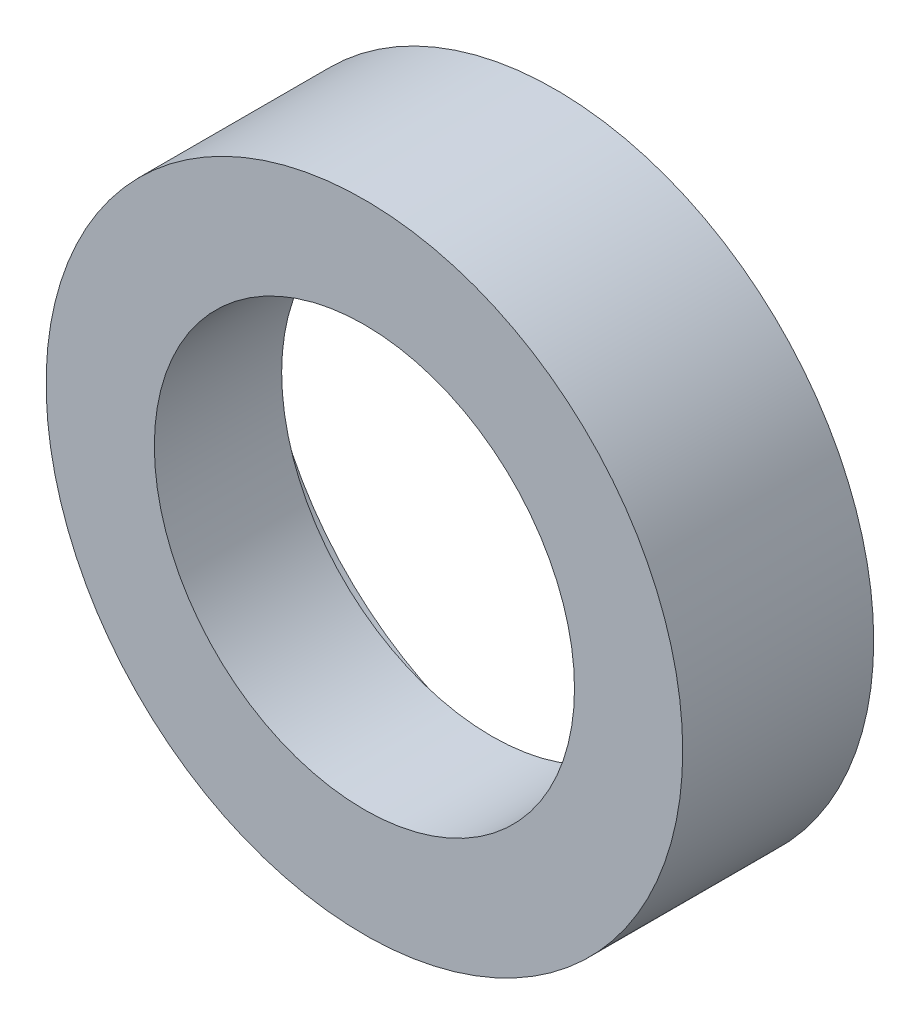
ISO-10303-21;
HEADER;
FILE_DESCRIPTION(('STEP AP214'),'2;1');
FILE_NAME('part.step','',(''),(''),'','','');
FILE_SCHEMA(('AUTOMOTIVE_DESIGN { 1 0 10303 214 1 1 1 1 }'));
ENDSEC;
DATA;
#1=APPLICATION_CONTEXT('core data for automotive mechanical design processes');
#2=APPLICATION_PROTOCOL_DEFINITION('international standard','automotive_design',2000,#1);
#3=PRODUCT_CONTEXT('',#1,'mechanical');
#4=PRODUCT('Part','Part','',(#3));
#5=PRODUCT_RELATED_PRODUCT_CATEGORY('part','',(#4));
#6=PRODUCT_DEFINITION_FORMATION('','',#4);
#7=PRODUCT_DEFINITION_CONTEXT('part definition',#1,'design');
#8=PRODUCT_DEFINITION('design','',#6,#7);
#9=PRODUCT_DEFINITION_SHAPE('','',#8);
#10=(LENGTH_UNIT() NAMED_UNIT(*) SI_UNIT(.MILLI.,.METRE.));
#11=(NAMED_UNIT(*) PLANE_ANGLE_UNIT() SI_UNIT($,.RADIAN.));
#12=(NAMED_UNIT(*) SI_UNIT($,.STERADIAN.) SOLID_ANGLE_UNIT());
#13=UNCERTAINTY_MEASURE_WITH_UNIT(LENGTH_MEASURE(1.E-05),#10,'distance_accuracy_value','');
#14=(GEOMETRIC_REPRESENTATION_CONTEXT(3) GLOBAL_UNCERTAINTY_ASSIGNED_CONTEXT((#13)) GLOBAL_UNIT_ASSIGNED_CONTEXT((#10,
#11,#12)) REPRESENTATION_CONTEXT('',''));
#15=CARTESIAN_POINT('',(0.,0.,0.));
#16=DIRECTION('',(0.,0.,1.));
#17=DIRECTION('',(1.,0.,0.));
#18=AXIS2_PLACEMENT_3D('',#15,#16,#17);
#19=CARTESIAN_POINT('',(0.,0.,0.));
#20=DIRECTION('',(0.,0.,1.));
#21=DIRECTION('',(1.,0.,0.));
#22=AXIS2_PLACEMENT_3D('',#19,#20,#21);
#23=PLANE('',#22);
#24=CARTESIAN_POINT('',(0.,0.,0.));
#25=DIRECTION('',(0.,0.,1.));
#26=DIRECTION('',(1.,0.,0.));
#27=AXIS2_PLACEMENT_3D('',#24,#25,#26);
#28=CIRCLE('',#27,50.);
#29=CARTESIAN_POINT('',(50.,0.,0.));
#30=VERTEX_POINT('',#29);
#31=EDGE_CURVE('E10',#30,#30,#28,.T.);
#32=ORIENTED_EDGE('',*,*,#31,.F.);
#33=EDGE_LOOP('',(#32));
#34=FACE_BOUND('',#33,.T.);
#35=CARTESIAN_POINT('',(0.,0.,0.));
#36=DIRECTION('',(0.,0.,1.));
#37=DIRECTION('',(1.,0.,0.));
#38=AXIS2_PLACEMENT_3D('',#35,#36,#37);
#39=CIRCLE('',#38,46.);
#40=CARTESIAN_POINT('',(46.,0.,0.));
#41=VERTEX_POINT('',#40);
#42=EDGE_CURVE('E38',#41,#41,#39,.T.);
#43=ORIENTED_EDGE('',*,*,#42,.T.);
#44=EDGE_LOOP('',(#43));
#45=FACE_BOUND('',#44,.T.);
#46=ADVANCED_FACE('F31',(#34,#45),#23,.F.);
#47=CARTESIAN_POINT('',(0.,0.,10.));
#48=DIRECTION('',(0.,0.,-1.));
#49=DIRECTION('',(-1.,0.,0.));
#50=AXIS2_PLACEMENT_3D('',#47,#48,#49);
#51=CYLINDRICAL_SURFACE('',#50,50.);
#52=ORIENTED_EDGE('',*,*,#31,.T.);
#53=EDGE_LOOP('',(#52));
#54=FACE_BOUND('',#53,.T.);
#55=CARTESIAN_POINT('',(0.,0.,30.));
#56=DIRECTION('',(0.,0.,1.));
#57=DIRECTION('',(1.,0.,0.));
#58=AXIS2_PLACEMENT_3D('',#55,#56,#57);
#59=CIRCLE('',#58,50.);
#60=CARTESIAN_POINT('',(50.,0.,30.));
#61=VERTEX_POINT('',#60);
#62=EDGE_CURVE('E46',#61,#61,#59,.T.);
#63=ORIENTED_EDGE('',*,*,#62,.F.);
#64=EDGE_LOOP('',(#63));
#65=FACE_BOUND('',#64,.T.);
#66=ADVANCED_FACE('F33',(#54,#65),#51,.T.);
#67=CARTESIAN_POINT('',(0.,0.,10.));
#68=DIRECTION('',(0.,0.,-1.));
#69=DIRECTION('',(-1.,0.,0.));
#70=AXIS2_PLACEMENT_3D('',#67,#68,#69);
#71=CYLINDRICAL_SURFACE('',#70,46.);
#72=CARTESIAN_POINT('',(0.,0.,10.));
#73=DIRECTION('',(0.,0.,1.));
#74=DIRECTION('',(1.,0.,0.));
#75=AXIS2_PLACEMENT_3D('',#72,#73,#74);
#76=CIRCLE('',#75,46.);
#77=CARTESIAN_POINT('',(46.,0.,10.));
#78=VERTEX_POINT('',#77);
#79=EDGE_CURVE('E42',#78,#78,#76,.T.);
#80=ORIENTED_EDGE('',*,*,#79,.T.);
#81=EDGE_LOOP('',(#80));
#82=FACE_BOUND('',#81,.T.);
#83=ORIENTED_EDGE('',*,*,#42,.F.);
#84=EDGE_LOOP('',(#83));
#85=FACE_BOUND('',#84,.T.);
#86=ADVANCED_FACE('F71',(#82,#85),#71,.F.);
#87=CARTESIAN_POINT('',(0.,0.,10.));
#88=DIRECTION('',(0.,0.,1.));
#89=DIRECTION('',(1.,0.,0.));
#90=AXIS2_PLACEMENT_3D('',#87,#88,#89);
#91=PLANE('',#90);
#92=CARTESIAN_POINT('',(0.,0.,10.));
#93=DIRECTION('',(0.,0.,1.));
#94=DIRECTION('',(1.,0.,0.));
#95=AXIS2_PLACEMENT_3D('',#92,#93,#94);
#96=CIRCLE('',#95,33.);
#97=CARTESIAN_POINT('',(33.,0.,10.));
#98=VERTEX_POINT('',#97);
#99=EDGE_CURVE('E52',#98,#98,#96,.T.);
#100=ORIENTED_EDGE('',*,*,#99,.T.);
#101=EDGE_LOOP('',(#100));
#102=FACE_BOUND('',#101,.T.);
#103=ORIENTED_EDGE('',*,*,#79,.F.);
#104=EDGE_LOOP('',(#103));
#105=FACE_BOUND('',#104,.T.);
#106=ADVANCED_FACE('F63',(#102,#105),#91,.F.);
#107=CARTESIAN_POINT('',(0.,0.,30.));
#108=DIRECTION('',(0.,0.,1.));
#109=DIRECTION('',(1.,0.,0.));
#110=AXIS2_PLACEMENT_3D('',#107,#108,#109);
#111=PLANE('',#110);
#112=ORIENTED_EDGE('',*,*,#62,.T.);
#113=EDGE_LOOP('',(#112));
#114=FACE_BOUND('',#113,.T.);
#115=CARTESIAN_POINT('',(0.,0.,30.));
#116=DIRECTION('',(0.,0.,1.));
#117=DIRECTION('',(1.,0.,0.));
#118=AXIS2_PLACEMENT_3D('',#115,#116,#117);
#119=CIRCLE('',#118,33.);
#120=CARTESIAN_POINT('',(33.,0.,30.));
#121=VERTEX_POINT('',#120);
#122=EDGE_CURVE('E51',#121,#121,#119,.T.);
#123=ORIENTED_EDGE('',*,*,#122,.F.);
#124=EDGE_LOOP('',(#123));
#125=FACE_BOUND('',#124,.T.);
#126=ADVANCED_FACE('F61',(#114,#125),#111,.T.);
#127=CARTESIAN_POINT('',(0.,0.,30.));
#128=DIRECTION('',(0.,0.,-1.));
#129=DIRECTION('',(-1.,0.,0.));
#130=AXIS2_PLACEMENT_3D('',#127,#128,#129);
#131=CYLINDRICAL_SURFACE('',#130,33.);
#132=ORIENTED_EDGE('',*,*,#122,.T.);
#133=EDGE_LOOP('',(#132));
#134=FACE_BOUND('',#133,.T.);
#135=ORIENTED_EDGE('',*,*,#99,.F.);
#136=EDGE_LOOP('',(#135));
#137=FACE_BOUND('',#136,.T.);
#138=ADVANCED_FACE('F58',(#134,#137),#131,.F.);
#139=CLOSED_SHELL('',(#46,#66,#86,#106,#126,#138));
#140=MANIFOLD_SOLID_BREP('B2',#139);
#141=ADVANCED_BREP_SHAPE_REPRESENTATION('',(#18,#140),#14);
#142=SHAPE_DEFINITION_REPRESENTATION(#9,#141);
ENDSEC;
END-ISO-10303-21;
